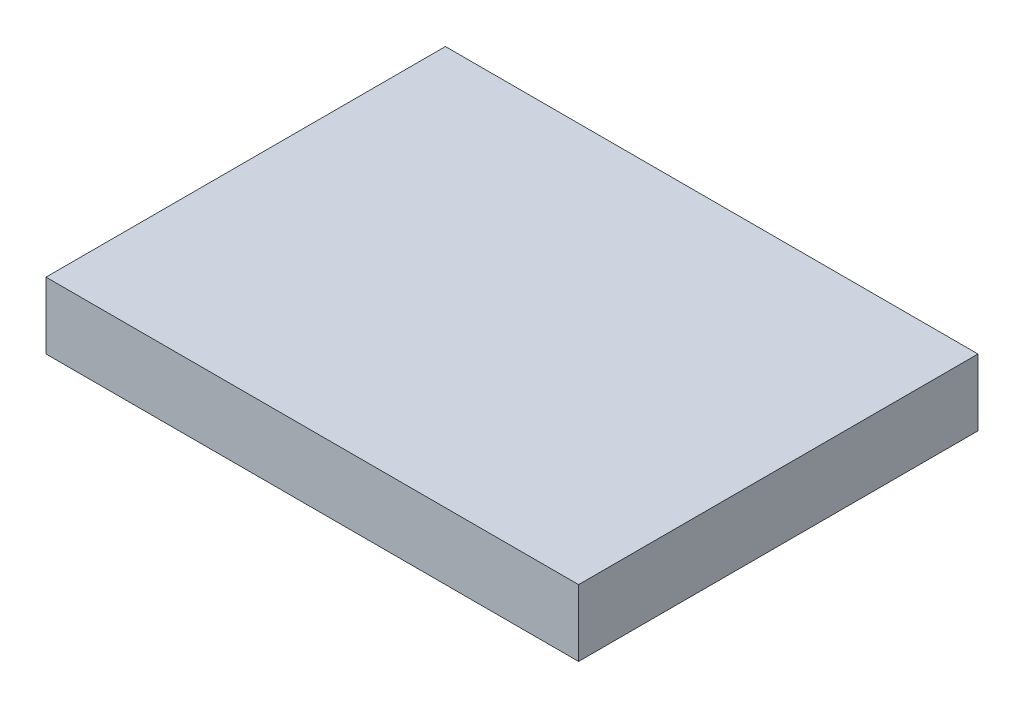
ISO-10303-21;
HEADER;
FILE_DESCRIPTION(('STEP AP214'),'2;1');
FILE_NAME('part.step','',(''),(''),'','','');
FILE_SCHEMA(('AUTOMOTIVE_DESIGN { 1 0 10303 214 1 1 1 1 }'));
ENDSEC;
DATA;
#1=APPLICATION_CONTEXT('core data for automotive mechanical design processes');
#2=APPLICATION_PROTOCOL_DEFINITION('international standard','automotive_design',2000,#1);
#3=PRODUCT_CONTEXT('',#1,'mechanical');
#4=PRODUCT('Part','Part','',(#3));
#5=PRODUCT_RELATED_PRODUCT_CATEGORY('part','',(#4));
#6=PRODUCT_DEFINITION_FORMATION('','',#4);
#7=PRODUCT_DEFINITION_CONTEXT('part definition',#1,'design');
#8=PRODUCT_DEFINITION('design','',#6,#7);
#9=PRODUCT_DEFINITION_SHAPE('','',#8);
#10=(LENGTH_UNIT() NAMED_UNIT(*) SI_UNIT(.MILLI.,.METRE.));
#11=(NAMED_UNIT(*) PLANE_ANGLE_UNIT() SI_UNIT($,.RADIAN.));
#12=(NAMED_UNIT(*) SI_UNIT($,.STERADIAN.) SOLID_ANGLE_UNIT());
#13=UNCERTAINTY_MEASURE_WITH_UNIT(LENGTH_MEASURE(1.E-05),#10,'distance_accuracy_value','');
#14=(GEOMETRIC_REPRESENTATION_CONTEXT(3) GLOBAL_UNCERTAINTY_ASSIGNED_CONTEXT((#13)) GLOBAL_UNIT_ASSIGNED_CONTEXT((#10,
#11,#12)) REPRESENTATION_CONTEXT('',''));
#15=CARTESIAN_POINT('',(0.,0.,0.));
#16=DIRECTION('',(0.,0.,1.));
#17=DIRECTION('',(1.,0.,0.));
#18=AXIS2_PLACEMENT_3D('',#15,#16,#17);
#19=CARTESIAN_POINT('',(25.6,1.62,13.06));
#20=DIRECTION('',(0.,1.,0.));
#21=DIRECTION('',(0.,0.,1.));
#22=AXIS2_PLACEMENT_3D('',#19,#20,#21);
#23=PLANE('',#22);
#24=DIRECTION('',(0.,0.,-1.));
#25=VECTOR('',#24,1.);
#26=CARTESIAN_POINT('',(26.4,1.62,13.36));
#27=LINE('',#26,#25);
#28=CARTESIAN_POINT('',(26.4,1.62,13.06));
#29=VERTEX_POINT('',#28);
#30=CARTESIAN_POINT('',(26.4,1.62,13.66));
#31=VERTEX_POINT('',#30);
#32=EDGE_CURVE('E55',#29,#31,#27,.F.);
#33=ORIENTED_EDGE('',*,*,#32,.F.);
#34=DIRECTION('',(-1.,0.,0.));
#35=VECTOR('',#34,1.);
#36=CARTESIAN_POINT('',(25.6,1.62,13.06));
#37=LINE('',#36,#35);
#38=CARTESIAN_POINT('',(25.6,1.62,13.06));
#39=VERTEX_POINT('',#38);
#40=EDGE_CURVE('E67',#39,#29,#37,.F.);
#41=ORIENTED_EDGE('',*,*,#40,.F.);
#42=DIRECTION('',(0.,0.,-1.));
#43=VECTOR('',#42,1.);
#44=CARTESIAN_POINT('',(25.6,1.62,13.36));
#45=LINE('',#44,#43);
#46=CARTESIAN_POINT('',(25.6,1.62,13.66));
#47=VERTEX_POINT('',#46);
#48=EDGE_CURVE('E20',#39,#47,#45,.F.);
#49=ORIENTED_EDGE('',*,*,#48,.T.);
#50=DIRECTION('',(1.,0.,0.));
#51=VECTOR('',#50,1.);
#52=CARTESIAN_POINT('',(25.6,1.62,13.66));
#53=LINE('',#52,#51);
#54=EDGE_CURVE('E81',#31,#47,#53,.F.);
#55=ORIENTED_EDGE('',*,*,#54,.F.);
#56=EDGE_LOOP('',(#33,#41,#49,#55));
#57=FACE_BOUND('',#56,.T.);
#58=ADVANCED_FACE('F17',(#57),#23,.T.);
#59=CARTESIAN_POINT('',(25.6,1.57,13.36));
#60=DIRECTION('',(1.,0.,0.));
#61=DIRECTION('',(0.,0.,-1.));
#62=AXIS2_PLACEMENT_3D('',#59,#60,#61);
#63=PLANE('',#62);
#64=DIRECTION('',(0.,1.,0.));
#65=VECTOR('',#64,1.);
#66=CARTESIAN_POINT('',(25.6,1.52,13.06));
#67=LINE('',#66,#65);
#68=CARTESIAN_POINT('',(25.6,1.52,13.06));
#69=VERTEX_POINT('',#68);
#70=EDGE_CURVE('E62',#69,#39,#67,.T.);
#71=ORIENTED_EDGE('',*,*,#70,.F.);
#72=DIRECTION('',(0.,0.,-1.));
#73=VECTOR('',#72,1.);
#74=CARTESIAN_POINT('',(25.6,1.52,13.66));
#75=LINE('',#74,#73);
#76=CARTESIAN_POINT('',(25.6,1.52,13.66));
#77=VERTEX_POINT('',#76);
#78=EDGE_CURVE('E83',#77,#69,#75,.T.);
#79=ORIENTED_EDGE('',*,*,#78,.F.);
#80=DIRECTION('',(0.,1.,0.));
#81=VECTOR('',#80,1.);
#82=CARTESIAN_POINT('',(25.6,1.62,13.66));
#83=LINE('',#82,#81);
#84=EDGE_CURVE('E65',#47,#77,#83,.F.);
#85=ORIENTED_EDGE('',*,*,#84,.F.);
#86=ORIENTED_EDGE('',*,*,#48,.F.);
#87=EDGE_LOOP('',(#71,#79,#85,#86));
#88=FACE_BOUND('',#87,.T.);
#89=ADVANCED_FACE('F60',(#88),#63,.F.);
#90=CARTESIAN_POINT('',(25.6,1.52,13.06));
#91=DIRECTION('',(0.,0.,-1.));
#92=DIRECTION('',(-1.,0.,0.));
#93=AXIS2_PLACEMENT_3D('',#90,#91,#92);
#94=PLANE('',#93);
#95=DIRECTION('',(0.,1.,0.));
#96=VECTOR('',#95,1.);
#97=CARTESIAN_POINT('',(26.4,1.57,13.06));
#98=LINE('',#97,#96);
#99=CARTESIAN_POINT('',(26.4,1.52,13.06));
#100=VERTEX_POINT('',#99);
#101=EDGE_CURVE('E77',#100,#29,#98,.T.);
#102=ORIENTED_EDGE('',*,*,#101,.F.);
#103=DIRECTION('',(1.,0.,0.));
#104=VECTOR('',#103,1.);
#105=CARTESIAN_POINT('',(25.6,1.52,13.06));
#106=LINE('',#105,#104);
#107=EDGE_CURVE('E73',#69,#100,#106,.T.);
#108=ORIENTED_EDGE('',*,*,#107,.F.);
#109=ORIENTED_EDGE('',*,*,#70,.T.);
#110=ORIENTED_EDGE('',*,*,#40,.T.);
#111=EDGE_LOOP('',(#102,#108,#109,#110));
#112=FACE_BOUND('',#111,.T.);
#113=ADVANCED_FACE('F71',(#112),#94,.T.);
#114=CARTESIAN_POINT('',(26.4,1.57,13.36));
#115=DIRECTION('',(1.,0.,0.));
#116=DIRECTION('',(0.,0.,-1.));
#117=AXIS2_PLACEMENT_3D('',#114,#115,#116);
#118=PLANE('',#117);
#119=DIRECTION('',(0.,0.,-1.));
#120=VECTOR('',#119,1.);
#121=CARTESIAN_POINT('',(26.4,1.52,13.66));
#122=LINE('',#121,#120);
#123=CARTESIAN_POINT('',(26.4,1.52,13.66));
#124=VERTEX_POINT('',#123);
#125=EDGE_CURVE('E26',#100,#124,#122,.F.);
#126=ORIENTED_EDGE('',*,*,#125,.F.);
#127=ORIENTED_EDGE('',*,*,#101,.T.);
#128=ORIENTED_EDGE('',*,*,#32,.T.);
#129=DIRECTION('',(0.,1.,0.));
#130=VECTOR('',#129,1.);
#131=CARTESIAN_POINT('',(26.4,1.62,13.66));
#132=LINE('',#131,#130);
#133=EDGE_CURVE('E35',#124,#31,#132,.T.);
#134=ORIENTED_EDGE('',*,*,#133,.F.);
#135=EDGE_LOOP('',(#126,#127,#128,#134));
#136=FACE_BOUND('',#135,.T.);
#137=ADVANCED_FACE('F89',(#136),#118,.T.);
#138=CARTESIAN_POINT('',(25.6,1.62,13.66));
#139=DIRECTION('',(0.,0.,1.));
#140=DIRECTION('',(1.,0.,0.));
#141=AXIS2_PLACEMENT_3D('',#138,#139,#140);
#142=PLANE('',#141);
#143=ORIENTED_EDGE('',*,*,#133,.T.);
#144=ORIENTED_EDGE('',*,*,#54,.T.);
#145=ORIENTED_EDGE('',*,*,#84,.T.);
#146=DIRECTION('',(1.,0.,0.));
#147=VECTOR('',#146,1.);
#148=CARTESIAN_POINT('',(25.6,1.52,13.66));
#149=LINE('',#148,#147);
#150=EDGE_CURVE('E11',#124,#77,#149,.F.);
#151=ORIENTED_EDGE('',*,*,#150,.F.);
#152=EDGE_LOOP('',(#143,#144,#145,#151));
#153=FACE_BOUND('',#152,.T.);
#154=ADVANCED_FACE('F91',(#153),#142,.T.);
#155=CARTESIAN_POINT('',(25.6,1.52,13.66));
#156=DIRECTION('',(0.,-1.,0.));
#157=DIRECTION('',(0.,0.,-1.));
#158=AXIS2_PLACEMENT_3D('',#155,#156,#157);
#159=PLANE('',#158);
#160=ORIENTED_EDGE('',*,*,#125,.T.);
#161=ORIENTED_EDGE('',*,*,#150,.T.);
#162=ORIENTED_EDGE('',*,*,#78,.T.);
#163=ORIENTED_EDGE('',*,*,#107,.T.);
#164=EDGE_LOOP('',(#160,#161,#162,#163));
#165=FACE_BOUND('',#164,.T.);
#166=ADVANCED_FACE('F88',(#165),#159,.T.);
#167=CLOSED_SHELL('',(#58,#89,#113,#137,#154,#166));
#168=MANIFOLD_SOLID_BREP('B1',#167);
#169=ADVANCED_BREP_SHAPE_REPRESENTATION('',(#18,#168),#14);
#170=SHAPE_DEFINITION_REPRESENTATION(#9,#169);
ENDSEC;
END-ISO-10303-21;
